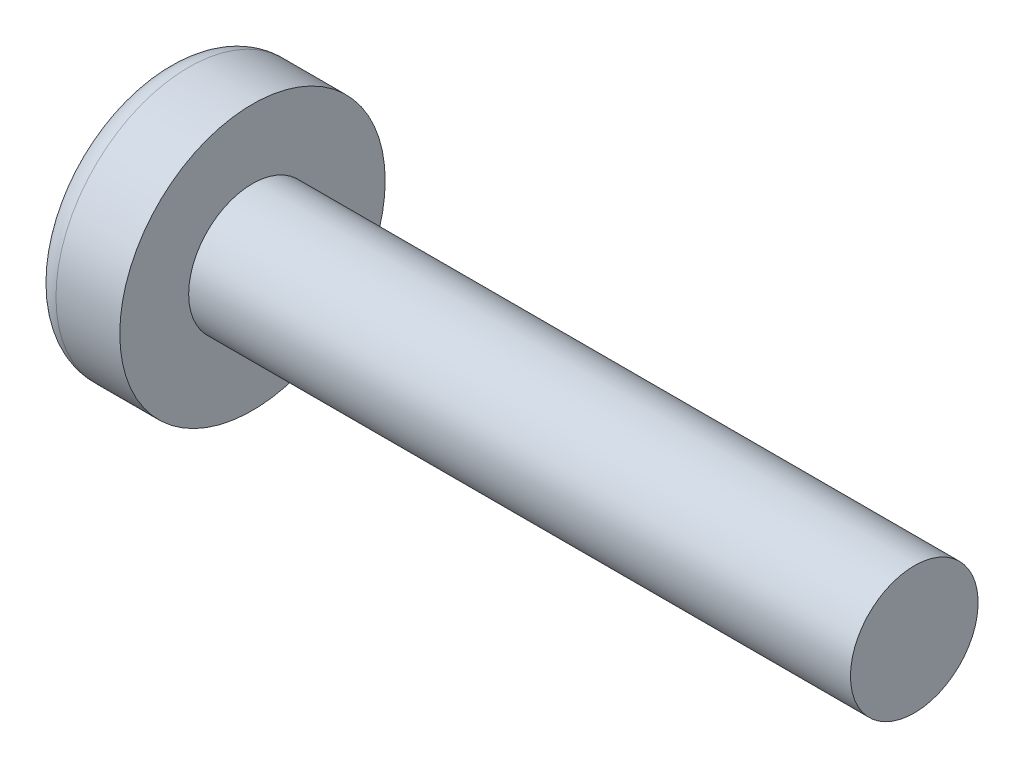
ISO-10303-21;
HEADER;
FILE_DESCRIPTION(('STEP AP214'),'2;1');
FILE_NAME('part.step','',(''),(''),'','','');
FILE_SCHEMA(('AUTOMOTIVE_DESIGN { 1 0 10303 214 1 1 1 1 }'));
ENDSEC;
DATA;
#1=APPLICATION_CONTEXT('core data for automotive mechanical design processes');
#2=APPLICATION_PROTOCOL_DEFINITION('international standard','automotive_design',2000,#1);
#3=PRODUCT_CONTEXT('',#1,'mechanical');
#4=PRODUCT('Part','Part','',(#3));
#5=PRODUCT_RELATED_PRODUCT_CATEGORY('part','',(#4));
#6=PRODUCT_DEFINITION_FORMATION('','',#4);
#7=PRODUCT_DEFINITION_CONTEXT('part definition',#1,'design');
#8=PRODUCT_DEFINITION('design','',#6,#7);
#9=PRODUCT_DEFINITION_SHAPE('','',#8);
#10=(LENGTH_UNIT() NAMED_UNIT(*) SI_UNIT(.MILLI.,.METRE.));
#11=(NAMED_UNIT(*) PLANE_ANGLE_UNIT() SI_UNIT($,.RADIAN.));
#12=(NAMED_UNIT(*) SI_UNIT($,.STERADIAN.) SOLID_ANGLE_UNIT());
#13=UNCERTAINTY_MEASURE_WITH_UNIT(LENGTH_MEASURE(1.E-05),#10,'distance_accuracy_value','');
#14=(GEOMETRIC_REPRESENTATION_CONTEXT(3) GLOBAL_UNCERTAINTY_ASSIGNED_CONTEXT((#13)) GLOBAL_UNIT_ASSIGNED_CONTEXT((#10,
#11,#12)) REPRESENTATION_CONTEXT('',''));
#15=CARTESIAN_POINT('',(0.,0.,0.));
#16=DIRECTION('',(0.,0.,1.));
#17=DIRECTION('',(1.,0.,0.));
#18=AXIS2_PLACEMENT_3D('',#15,#16,#17);
#19=CARTESIAN_POINT('',(5.,0.,0.));
#20=DIRECTION('',(-1.,0.,0.));
#21=DIRECTION('',(0.,1.,0.));
#22=AXIS2_PLACEMENT_3D('',#19,#20,#21);
#23=SPHERICAL_SURFACE('',#22,5.);
#24=CARTESIAN_POINT('',(0.312639345115148,0.,0.));
#25=DIRECTION('',(-1.,0.,0.));
#26=DIRECTION('',(0.,0.,1.));
#27=AXIS2_PLACEMENT_3D('',#24,#25,#26);
#28=CIRCLE('',#27,1.74030172413793);
#29=CARTESIAN_POINT('',(0.312639345115148,0.,1.74030172413793));
#30=VERTEX_POINT('',#29);
#31=EDGE_CURVE('E153',#30,#30,#28,.T.);
#32=ORIENTED_EDGE('',*,*,#31,.T.);
#33=EDGE_LOOP('',(#32));
#34=FACE_BOUND('',#33,.T.);
#35=CARTESIAN_POINT('',(4.98382636322272,-0.153868112043298,0.));
#36=DIRECTION('',(-0.104537710696287,-0.994520923380891,0.));
#37=DIRECTION('',(0.994520923380891,-0.104537710696287,0.));
#38=AXIS2_PLACEMENT_3D('',#35,#36,#37);
#39=CIRCLE('',#38,4.99760572850336);
#40=CARTESIAN_POINT('',(0.188596138461546,0.350175974082162,1.31444652548076));
#41=VERTEX_POINT('',#40);
#42=CARTESIAN_POINT('',(0.0270341343313624,0.367158343834486,0.367158343834487));
#43=VERTEX_POINT('',#42);
#44=EDGE_CURVE('E184',#41,#43,#39,.T.);
#45=ORIENTED_EDGE('',*,*,#44,.F.);
#46=CARTESIAN_POINT('',(3.98403090792016,0.,-1.41352221506761));
#47=DIRECTION('',(0.583636048152575,0.,0.812015371342713));
#48=DIRECTION('',(0.812015371342714,0.,-0.583636048152575));
#49=AXIS2_PLACEMENT_3D('',#46,#47,#48);
#50=CIRCLE('',#49,4.68719124331927);
#51=CARTESIAN_POINT('',(0.188596138461545,-0.350175974082171,1.31444652548076));
#52=VERTEX_POINT('',#51);
#53=EDGE_CURVE('E149',#41,#52,#50,.T.);
#54=ORIENTED_EDGE('',*,*,#53,.T.);
#55=CARTESIAN_POINT('',(4.98382636322272,0.153868112043297,0.));
#56=DIRECTION('',(-0.104537710696287,0.994520923380891,0.));
#57=DIRECTION('',(-0.994520923380891,-0.104537710696287,0.));
#58=AXIS2_PLACEMENT_3D('',#55,#56,#57);
#59=CIRCLE('',#58,4.99760572850336);
#60=CARTESIAN_POINT('',(0.0270341343313616,-0.367158343834489,0.367158343834487));
#61=VERTEX_POINT('',#60);
#62=EDGE_CURVE('E105',#61,#52,#59,.T.);
#63=ORIENTED_EDGE('',*,*,#62,.F.);
#64=CARTESIAN_POINT('',(4.98382636322272,0.,-0.153868112043297));
#65=DIRECTION('',(-0.104537710696287,0.,-0.994520923380891));
#66=DIRECTION('',(-0.994520923380891,0.,0.104537710696287));
#67=AXIS2_PLACEMENT_3D('',#64,#65,#66);
#68=CIRCLE('',#67,4.99760572850336);
#69=CARTESIAN_POINT('',(0.188596138461545,-1.31444652548077,0.350175974082167));
#70=VERTEX_POINT('',#69);
#71=EDGE_CURVE('E130',#70,#61,#68,.T.);
#72=ORIENTED_EDGE('',*,*,#71,.F.);
#73=CARTESIAN_POINT('',(3.98403090792016,1.41352221506761,0.));
#74=DIRECTION('',(0.583636048152575,-0.812015371342713,0.));
#75=DIRECTION('',(0.812015371342714,0.583636048152575,0.));
#76=AXIS2_PLACEMENT_3D('',#73,#74,#75);
#77=CIRCLE('',#76,4.68719124331927);
#78=CARTESIAN_POINT('',(0.188596138461545,-1.31444652548077,-0.350175974082167));
#79=VERTEX_POINT('',#78);
#80=EDGE_CURVE('E138',#70,#79,#77,.T.);
#81=ORIENTED_EDGE('',*,*,#80,.T.);
#82=CARTESIAN_POINT('',(4.98382636322272,0.,0.153868112043297));
#83=DIRECTION('',(-0.104537710696287,0.,0.994520923380891));
#84=DIRECTION('',(0.994520923380891,0.,0.104537710696287));
#85=AXIS2_PLACEMENT_3D('',#82,#83,#84);
#86=CIRCLE('',#85,4.99760572850336);
#87=CARTESIAN_POINT('',(0.0270341343313624,-0.367158343834486,-0.367158343834487));
#88=VERTEX_POINT('',#87);
#89=EDGE_CURVE('E48',#88,#79,#86,.T.);
#90=ORIENTED_EDGE('',*,*,#89,.F.);
#91=CARTESIAN_POINT('',(0.188596138461545,-0.350175974082162,-1.31444652548077));
#92=VERTEX_POINT('',#91);
#93=EDGE_CURVE('E191',#92,#88,#59,.T.);
#94=ORIENTED_EDGE('',*,*,#93,.F.);
#95=CARTESIAN_POINT('',(3.98403090792016,0.,1.41352221506761));
#96=DIRECTION('',(0.583636048152575,0.,-0.812015371342713));
#97=DIRECTION('',(-0.812015371342714,0.,-0.583636048152575));
#98=AXIS2_PLACEMENT_3D('',#95,#96,#97);
#99=CIRCLE('',#98,4.68719124331927);
#100=CARTESIAN_POINT('',(0.188596138461545,0.350175974082172,-1.31444652548076));
#101=VERTEX_POINT('',#100);
#102=EDGE_CURVE('E131',#92,#101,#99,.T.);
#103=ORIENTED_EDGE('',*,*,#102,.T.);
#104=CARTESIAN_POINT('',(0.0270341343313624,0.367158343834489,-0.367158343834487));
#105=VERTEX_POINT('',#104);
#106=EDGE_CURVE('E179',#105,#101,#39,.T.);
#107=ORIENTED_EDGE('',*,*,#106,.F.);
#108=CARTESIAN_POINT('',(0.188596138461546,1.31444652548076,-0.350175974082167));
#109=VERTEX_POINT('',#108);
#110=EDGE_CURVE('E41',#109,#105,#86,.T.);
#111=ORIENTED_EDGE('',*,*,#110,.F.);
#112=CARTESIAN_POINT('',(3.98403090792016,-1.41352221506761,0.));
#113=DIRECTION('',(0.583636048152575,0.812015371342713,0.));
#114=DIRECTION('',(-0.812015371342714,0.583636048152575,0.));
#115=AXIS2_PLACEMENT_3D('',#112,#113,#114);
#116=CIRCLE('',#115,4.68719124331927);
#117=CARTESIAN_POINT('',(0.188596138461546,1.31444652548076,0.350175974082167));
#118=VERTEX_POINT('',#117);
#119=EDGE_CURVE('E11',#109,#118,#116,.T.);
#120=ORIENTED_EDGE('',*,*,#119,.T.);
#121=EDGE_CURVE('E167',#43,#118,#68,.T.);
#122=ORIENTED_EDGE('',*,*,#121,.F.);
#123=EDGE_LOOP('',(#45,#54,#63,#72,#81,#90,#94,#103,#107,#111,#120,#122));
#124=FACE_BOUND('',#123,.T.);
#125=ADVANCED_FACE('F33',(#34,#124),#23,.T.);
#126=CARTESIAN_POINT('',(2.01739130434783,0.,-0.15794466403162));
#127=DIRECTION('',(-0.104537710696287,0.,0.994520923380891));
#128=DIRECTION('',(0.994520923380891,0.,0.104537710696287));
#129=AXIS2_PLACEMENT_3D('',#126,#127,#128);
#130=PLANE('',#129);
#131=ORIENTED_EDGE('',*,*,#110,.T.);
#132=DIRECTION('',(0.989130931836555,-0.103971149085093,0.103971149085092));
#133=VECTOR('',#132,1.);
#134=CARTESIAN_POINT('',(2.03363450411053,0.156237282238383,-0.156237282238382));
#135=LINE('',#134,#133);
#136=CARTESIAN_POINT('',(1.76,0.185000000000001,-0.184999999999999));
#137=VERTEX_POINT('',#136);
#138=EDGE_CURVE('E173',#105,#137,#135,.T.);
#139=ORIENTED_EDGE('',*,*,#138,.T.);
#140=DIRECTION('',(0.80907355338853,-0.581521616498006,0.0850446632823171));
#141=VECTOR('',#140,1.);
#142=CARTESIAN_POINT('',(0.,1.45,-0.37));
#143=LINE('',#142,#141);
#144=EDGE_CURVE('E154',#109,#137,#143,.T.);
#145=ORIENTED_EDGE('',*,*,#144,.F.);
#146=EDGE_LOOP('',(#131,#139,#145));
#147=FACE_BOUND('',#146,.T.);
#148=ADVANCED_FACE('F172',(#147),#130,.T.);
#149=DIRECTION('',(0.80907355338853,0.581521616498006,0.0850446632823171));
#150=VECTOR('',#149,1.);
#151=CARTESIAN_POINT('',(0.,-1.45,-0.37));
#152=LINE('',#151,#150);
#153=CARTESIAN_POINT('',(1.76,-0.185,-0.185));
#154=VERTEX_POINT('',#153);
#155=EDGE_CURVE('E139',#79,#154,#152,.T.);
#156=ORIENTED_EDGE('',*,*,#155,.T.);
#157=DIRECTION('',(-0.989130931836555,-0.103971149085092,-0.103971149085092));
#158=VECTOR('',#157,1.);
#159=CARTESIAN_POINT('',(2.03363450411053,-0.156237282238382,-0.156237282238382));
#160=LINE('',#159,#158);
#161=EDGE_CURVE('E194',#154,#88,#160,.T.);
#162=ORIENTED_EDGE('',*,*,#161,.T.);
#163=ORIENTED_EDGE('',*,*,#89,.T.);
#164=EDGE_LOOP('',(#156,#162,#163));
#165=FACE_BOUND('',#164,.T.);
#166=ADVANCED_FACE('F209',(#165),#130,.T.);
#167=CARTESIAN_POINT('',(2.01739130434783,0.,0.157944664031621));
#168=DIRECTION('',(-0.104537710696287,0.,-0.994520923380891));
#169=DIRECTION('',(-0.994520923380891,0.,0.104537710696287));
#170=AXIS2_PLACEMENT_3D('',#167,#168,#169);
#171=PLANE('',#170);
#172=DIRECTION('',(0.80907355338853,-0.581521616498006,-0.085044663282317));
#173=VECTOR('',#172,1.);
#174=CARTESIAN_POINT('',(0.,1.45,0.37));
#175=LINE('',#174,#173);
#176=CARTESIAN_POINT('',(1.76,0.185,0.185));
#177=VERTEX_POINT('',#176);
#178=EDGE_CURVE('E210',#118,#177,#175,.T.);
#179=ORIENTED_EDGE('',*,*,#178,.T.);
#180=DIRECTION('',(-0.989130931836555,0.103971149085092,0.103971149085092));
#181=VECTOR('',#180,1.);
#182=CARTESIAN_POINT('',(2.03363450411053,0.156237282238382,0.156237282238382));
#183=LINE('',#182,#181);
#184=EDGE_CURVE('E188',#177,#43,#183,.T.);
#185=ORIENTED_EDGE('',*,*,#184,.T.);
#186=ORIENTED_EDGE('',*,*,#121,.T.);
#187=EDGE_LOOP('',(#179,#185,#186));
#188=FACE_BOUND('',#187,.T.);
#189=ADVANCED_FACE('F214',(#188),#171,.T.);
#190=ORIENTED_EDGE('',*,*,#71,.T.);
#191=DIRECTION('',(0.989130931836555,0.103971149085093,-0.103971149085092));
#192=VECTOR('',#191,1.);
#193=CARTESIAN_POINT('',(2.03363450411053,-0.156237282238383,0.156237282238382));
#194=LINE('',#193,#192);
#195=CARTESIAN_POINT('',(1.76,-0.185000000000001,0.184999999999999));
#196=VERTEX_POINT('',#195);
#197=EDGE_CURVE('E103',#61,#196,#194,.T.);
#198=ORIENTED_EDGE('',*,*,#197,.T.);
#199=DIRECTION('',(0.80907355338853,0.581521616498006,-0.0850446632823168));
#200=VECTOR('',#199,1.);
#201=CARTESIAN_POINT('',(0.,-1.45,0.369999999999999));
#202=LINE('',#201,#200);
#203=EDGE_CURVE('E128',#70,#196,#202,.T.);
#204=ORIENTED_EDGE('',*,*,#203,.F.);
#205=EDGE_LOOP('',(#190,#198,#204));
#206=FACE_BOUND('',#205,.T.);
#207=ADVANCED_FACE('F127',(#206),#171,.T.);
#208=CARTESIAN_POINT('',(-25.4,0.,0.));
#209=DIRECTION('',(-1.,0.,0.));
#210=DIRECTION('',(0.,0.,1.));
#211=AXIS2_PLACEMENT_3D('',#208,#209,#210);
#212=CYLINDRICAL_SURFACE('',#211,0.95);
#213=CARTESIAN_POINT('',(11.45,0.,0.));
#214=DIRECTION('',(-1.,0.,0.));
#215=DIRECTION('',(0.,0.,1.));
#216=AXIS2_PLACEMENT_3D('',#213,#214,#215);
#217=CIRCLE('',#216,0.95);
#218=CARTESIAN_POINT('',(11.45,0.,0.95));
#219=VERTEX_POINT('',#218);
#220=EDGE_CURVE('E150',#219,#219,#217,.T.);
#221=ORIENTED_EDGE('',*,*,#220,.T.);
#222=EDGE_LOOP('',(#221));
#223=FACE_BOUND('',#222,.T.);
#224=CARTESIAN_POINT('',(1.6,0.,0.));
#225=DIRECTION('',(-1.,0.,0.));
#226=DIRECTION('',(0.,0.,1.));
#227=AXIS2_PLACEMENT_3D('',#224,#225,#226);
#228=CIRCLE('',#227,0.95);
#229=CARTESIAN_POINT('',(1.6,0.,0.95));
#230=VERTEX_POINT('',#229);
#231=EDGE_CURVE('E163',#230,#230,#228,.T.);
#232=ORIENTED_EDGE('',*,*,#231,.F.);
#233=EDGE_LOOP('',(#232));
#234=FACE_BOUND('',#233,.T.);
#235=ADVANCED_FACE('F35',(#223,#234),#212,.T.);
#236=CARTESIAN_POINT('',(1.6,0.95,0.));
#237=DIRECTION('',(-1.,0.,0.));
#238=DIRECTION('',(0.,0.,1.));
#239=AXIS2_PLACEMENT_3D('',#236,#237,#238);
#240=PLANE('',#239);
#241=CARTESIAN_POINT('',(1.6,0.,0.));
#242=DIRECTION('',(-1.,0.,0.));
#243=DIRECTION('',(0.,0.,1.));
#244=AXIS2_PLACEMENT_3D('',#241,#242,#243);
#245=CIRCLE('',#244,1.975);
#246=CARTESIAN_POINT('',(1.6,0.,1.975));
#247=VERTEX_POINT('',#246);
#248=EDGE_CURVE('E160',#247,#247,#245,.T.);
#249=ORIENTED_EDGE('',*,*,#248,.F.);
#250=EDGE_LOOP('',(#249));
#251=FACE_BOUND('',#250,.T.);
#252=ORIENTED_EDGE('',*,*,#231,.T.);
#253=EDGE_LOOP('',(#252));
#254=FACE_BOUND('',#253,.T.);
#255=ADVANCED_FACE('F242',(#251,#254),#240,.F.);
#256=CARTESIAN_POINT('',(-25.4,0.,0.));
#257=DIRECTION('',(-1.,0.,0.));
#258=DIRECTION('',(0.,0.,1.));
#259=AXIS2_PLACEMENT_3D('',#256,#257,#258);
#260=CYLINDRICAL_SURFACE('',#259,1.975);
#261=ORIENTED_EDGE('',*,*,#248,.T.);
#262=EDGE_LOOP('',(#261));
#263=FACE_BOUND('',#262,.T.);
#264=CARTESIAN_POINT('',(0.650129312266857,0.,0.));
#265=DIRECTION('',(-1.,0.,0.));
#266=DIRECTION('',(0.,0.,1.));
#267=AXIS2_PLACEMENT_3D('',#264,#265,#266);
#268=CIRCLE('',#267,1.975);
#269=CARTESIAN_POINT('',(0.650129312266857,0.,1.975));
#270=VERTEX_POINT('',#269);
#271=EDGE_CURVE('E157',#270,#270,#268,.T.);
#272=ORIENTED_EDGE('',*,*,#271,.F.);
#273=EDGE_LOOP('',(#272));
#274=FACE_BOUND('',#273,.T.);
#275=ADVANCED_FACE('F239',(#263,#274),#260,.T.);
#276=CARTESIAN_POINT('',(0.650129312266858,0.,0.));
#277=DIRECTION('',(-1.,0.,0.));
#278=DIRECTION('',(0.,0.,1.));
#279=AXIS2_PLACEMENT_3D('',#276,#277,#278);
#280=TOROIDAL_SURFACE('',#279,1.615,0.36);
#281=ORIENTED_EDGE('',*,*,#271,.T.);
#282=EDGE_LOOP('',(#281));
#283=FACE_BOUND('',#282,.T.);
#284=ORIENTED_EDGE('',*,*,#31,.F.);
#285=EDGE_LOOP('',(#284));
#286=FACE_BOUND('',#285,.T.);
#287=ADVANCED_FACE('F236',(#283,#286),#280,.T.);
#288=CARTESIAN_POINT('',(11.45,0.95,0.));
#289=DIRECTION('',(1.,0.,0.));
#290=DIRECTION('',(0.,0.,-1.));
#291=AXIS2_PLACEMENT_3D('',#288,#289,#290);
#292=PLANE('',#291);
#293=ORIENTED_EDGE('',*,*,#220,.F.);
#294=EDGE_LOOP('',(#293));
#295=FACE_BOUND('',#294,.T.);
#296=ADVANCED_FACE('F234',(#295),#292,.T.);
#297=CARTESIAN_POINT('',(1.76,0.185,0.185));
#298=DIRECTION('',(0.583636048152575,0.812015371342713,0.));
#299=DIRECTION('',(-0.812015371342714,0.583636048152575,0.));
#300=AXIS2_PLACEMENT_3D('',#297,#298,#299);
#301=PLANE('',#300);
#302=ORIENTED_EDGE('',*,*,#144,.T.);
#303=DIRECTION('',(0.,0.,-1.));
#304=VECTOR('',#303,1.);
#305=CARTESIAN_POINT('',(1.76,0.185,0.185));
#306=LINE('',#305,#304);
#307=EDGE_CURVE('E121',#177,#137,#306,.T.);
#308=ORIENTED_EDGE('',*,*,#307,.F.);
#309=ORIENTED_EDGE('',*,*,#178,.F.);
#310=ORIENTED_EDGE('',*,*,#119,.F.);
#311=EDGE_LOOP('',(#302,#308,#309,#310));
#312=FACE_BOUND('',#311,.T.);
#313=ADVANCED_FACE('F213',(#312),#301,.F.);
#314=CARTESIAN_POINT('',(1.76,-0.185,-0.185));
#315=DIRECTION('',(0.583636048152575,-0.812015371342713,0.));
#316=DIRECTION('',(0.812015371342714,0.583636048152575,0.));
#317=AXIS2_PLACEMENT_3D('',#314,#315,#316);
#318=PLANE('',#317);
#319=ORIENTED_EDGE('',*,*,#203,.T.);
#320=DIRECTION('',(0.,0.,1.));
#321=VECTOR('',#320,1.);
#322=CARTESIAN_POINT('',(1.76,-0.185,-0.185));
#323=LINE('',#322,#321);
#324=EDGE_CURVE('E120',#154,#196,#323,.T.);
#325=ORIENTED_EDGE('',*,*,#324,.F.);
#326=ORIENTED_EDGE('',*,*,#155,.F.);
#327=ORIENTED_EDGE('',*,*,#80,.F.);
#328=EDGE_LOOP('',(#319,#325,#326,#327));
#329=FACE_BOUND('',#328,.T.);
#330=ADVANCED_FACE('F135',(#329),#318,.F.);
#331=CARTESIAN_POINT('',(1.76,0.185,-0.185));
#332=DIRECTION('',(-1.,0.,0.));
#333=DIRECTION('',(0.,0.,1.));
#334=AXIS2_PLACEMENT_3D('',#331,#332,#333);
#335=PLANE('',#334);
#336=DIRECTION('',(0.,1.,0.));
#337=VECTOR('',#336,1.);
#338=CARTESIAN_POINT('',(1.76,-0.185,-0.185));
#339=LINE('',#338,#337);
#340=EDGE_CURVE('E143',#154,#137,#339,.T.);
#341=ORIENTED_EDGE('',*,*,#340,.F.);
#342=ORIENTED_EDGE('',*,*,#324,.T.);
#343=DIRECTION('',(0.,-1.,0.));
#344=VECTOR('',#343,1.);
#345=CARTESIAN_POINT('',(1.76,0.185,0.185));
#346=LINE('',#345,#344);
#347=EDGE_CURVE('E112',#177,#196,#346,.T.);
#348=ORIENTED_EDGE('',*,*,#347,.F.);
#349=ORIENTED_EDGE('',*,*,#307,.T.);
#350=EDGE_LOOP('',(#341,#342,#348,#349));
#351=FACE_BOUND('',#350,.T.);
#352=ADVANCED_FACE('F141',(#351),#335,.T.);
#353=CARTESIAN_POINT('',(1.76,0.185000000000001,-0.184999999999999));
#354=DIRECTION('',(0.583636048152575,0.,-0.812015371342713));
#355=DIRECTION('',(0.812015371342714,0.,0.583636048152575));
#356=AXIS2_PLACEMENT_3D('',#353,#354,#355);
#357=PLANE('',#356);
#358=DIRECTION('',(0.80907355338853,0.0850446632823148,0.581521616498006));
#359=VECTOR('',#358,1.);
#360=CARTESIAN_POINT('',(0.,-0.369999999999994,-1.45));
#361=LINE('',#360,#359);
#362=EDGE_CURVE('E199',#92,#154,#361,.T.);
#363=ORIENTED_EDGE('',*,*,#362,.T.);
#364=ORIENTED_EDGE('',*,*,#340,.T.);
#365=DIRECTION('',(0.80907355338853,-0.0850446632823191,0.581521616498006));
#366=VECTOR('',#365,1.);
#367=CARTESIAN_POINT('',(0.,0.370000000000005,-1.45));
#368=LINE('',#367,#366);
#369=EDGE_CURVE('E109',#101,#137,#368,.T.);
#370=ORIENTED_EDGE('',*,*,#369,.F.);
#371=ORIENTED_EDGE('',*,*,#102,.F.);
#372=EDGE_LOOP('',(#363,#364,#370,#371));
#373=FACE_BOUND('',#372,.T.);
#374=ADVANCED_FACE('F204',(#373),#357,.F.);
#375=CARTESIAN_POINT('',(2.01739130434783,-0.157944664031621,0.));
#376=DIRECTION('',(-0.104537710696287,0.994520923380891,0.));
#377=DIRECTION('',(-0.994520923380891,-0.104537710696287,0.));
#378=AXIS2_PLACEMENT_3D('',#375,#376,#377);
#379=PLANE('',#378);
#380=ORIENTED_EDGE('',*,*,#93,.T.);
#381=ORIENTED_EDGE('',*,*,#161,.F.);
#382=ORIENTED_EDGE('',*,*,#362,.F.);
#383=EDGE_LOOP('',(#380,#381,#382));
#384=FACE_BOUND('',#383,.T.);
#385=ADVANCED_FACE('F208',(#384),#379,.T.);
#386=CARTESIAN_POINT('',(2.01739130434783,0.15794466403162,0.));
#387=DIRECTION('',(-0.104537710696287,-0.994520923380891,0.));
#388=DIRECTION('',(0.994520923380891,-0.104537710696287,0.));
#389=AXIS2_PLACEMENT_3D('',#386,#387,#388);
#390=PLANE('',#389);
#391=ORIENTED_EDGE('',*,*,#106,.T.);
#392=ORIENTED_EDGE('',*,*,#369,.T.);
#393=ORIENTED_EDGE('',*,*,#138,.F.);
#394=EDGE_LOOP('',(#391,#392,#393));
#395=FACE_BOUND('',#394,.T.);
#396=ADVANCED_FACE('F202',(#395),#390,.T.);
#397=CARTESIAN_POINT('',(1.76,-0.185000000000001,0.184999999999999));
#398=DIRECTION('',(0.583636048152575,0.,0.812015371342713));
#399=DIRECTION('',(-0.812015371342714,0.,0.583636048152575));
#400=AXIS2_PLACEMENT_3D('',#397,#398,#399);
#401=PLANE('',#400);
#402=DIRECTION('',(0.80907355338853,-0.0850446632823151,-0.581521616498006));
#403=VECTOR('',#402,1.);
#404=CARTESIAN_POINT('',(0.,0.369999999999995,1.45));
#405=LINE('',#404,#403);
#406=EDGE_CURVE('E108',#41,#177,#405,.T.);
#407=ORIENTED_EDGE('',*,*,#406,.T.);
#408=ORIENTED_EDGE('',*,*,#347,.T.);
#409=DIRECTION('',(0.80907355338853,0.085044663282319,-0.581521616498006));
#410=VECTOR('',#409,1.);
#411=CARTESIAN_POINT('',(0.,-0.370000000000005,1.45));
#412=LINE('',#411,#410);
#413=EDGE_CURVE('E99',#52,#196,#412,.T.);
#414=ORIENTED_EDGE('',*,*,#413,.F.);
#415=ORIENTED_EDGE('',*,*,#53,.F.);
#416=EDGE_LOOP('',(#407,#408,#414,#415));
#417=FACE_BOUND('',#416,.T.);
#418=ADVANCED_FACE('F113',(#417),#401,.F.);
#419=ORIENTED_EDGE('',*,*,#44,.T.);
#420=ORIENTED_EDGE('',*,*,#184,.F.);
#421=ORIENTED_EDGE('',*,*,#406,.F.);
#422=EDGE_LOOP('',(#419,#420,#421));
#423=FACE_BOUND('',#422,.T.);
#424=ADVANCED_FACE('F215',(#423),#390,.T.);
#425=ORIENTED_EDGE('',*,*,#62,.T.);
#426=ORIENTED_EDGE('',*,*,#413,.T.);
#427=ORIENTED_EDGE('',*,*,#197,.F.);
#428=EDGE_LOOP('',(#425,#426,#427));
#429=FACE_BOUND('',#428,.T.);
#430=ADVANCED_FACE('F101',(#429),#379,.T.);
#431=CLOSED_SHELL('',(#125,#148,#166,#189,#207,#235,#255,#275,#287,#296,#313,#330,#352,#374,
#385,#396,#418,#424,#430));
#432=MANIFOLD_SOLID_BREP('B2',#431);
#433=ADVANCED_BREP_SHAPE_REPRESENTATION('',(#18,#432),#14);
#434=SHAPE_DEFINITION_REPRESENTATION(#9,#433);
ENDSEC;
END-ISO-10303-21;
